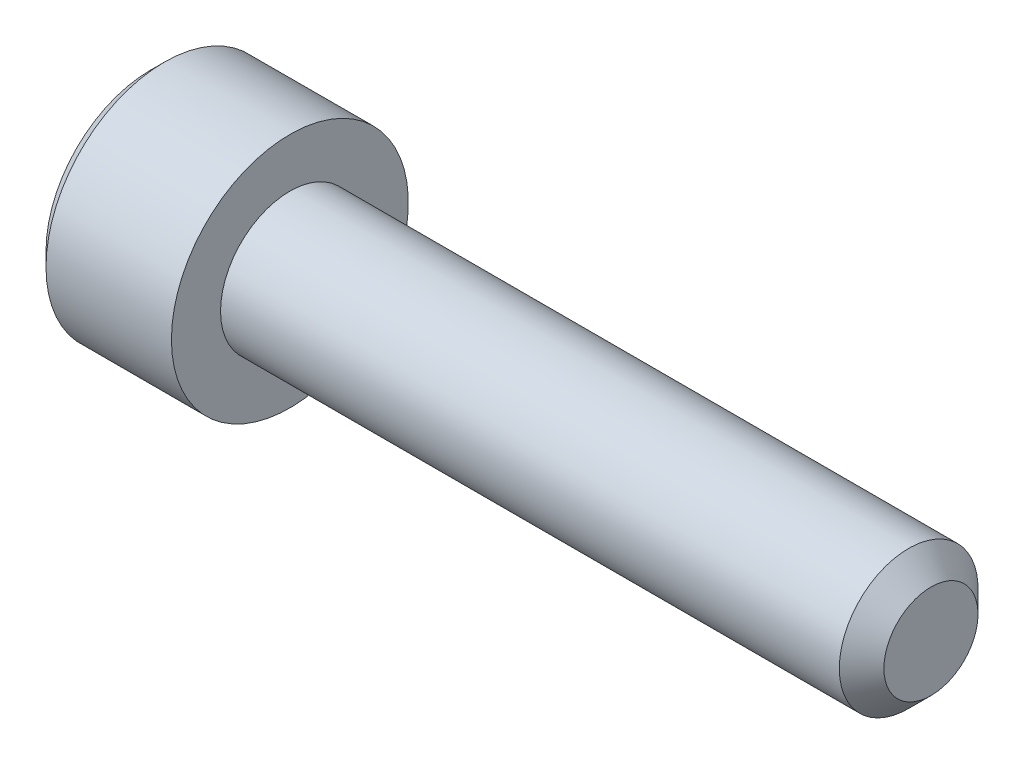
ISO-10303-21;
HEADER;
FILE_DESCRIPTION(('STEP AP214'),'2;1');
FILE_NAME('part.step','',(''),(''),'','','');
FILE_SCHEMA(('AUTOMOTIVE_DESIGN { 1 0 10303 214 1 1 1 1 }'));
ENDSEC;
DATA;
#1=APPLICATION_CONTEXT('core data for automotive mechanical design processes');
#2=APPLICATION_PROTOCOL_DEFINITION('international standard','automotive_design',2000,#1);
#3=PRODUCT_CONTEXT('',#1,'mechanical');
#4=PRODUCT('Part','Part','',(#3));
#5=PRODUCT_RELATED_PRODUCT_CATEGORY('part','',(#4));
#6=PRODUCT_DEFINITION_FORMATION('','',#4);
#7=PRODUCT_DEFINITION_CONTEXT('part definition',#1,'design');
#8=PRODUCT_DEFINITION('design','',#6,#7);
#9=PRODUCT_DEFINITION_SHAPE('','',#8);
#10=(LENGTH_UNIT() NAMED_UNIT(*) SI_UNIT(.MILLI.,.METRE.));
#11=(NAMED_UNIT(*) PLANE_ANGLE_UNIT() SI_UNIT($,.RADIAN.));
#12=(NAMED_UNIT(*) SI_UNIT($,.STERADIAN.) SOLID_ANGLE_UNIT());
#13=UNCERTAINTY_MEASURE_WITH_UNIT(LENGTH_MEASURE(1.E-05),#10,'distance_accuracy_value','');
#14=(GEOMETRIC_REPRESENTATION_CONTEXT(3) GLOBAL_UNCERTAINTY_ASSIGNED_CONTEXT((#13)) GLOBAL_UNIT_ASSIGNED_CONTEXT((#10,
#11,#12)) REPRESENTATION_CONTEXT('',''));
#15=CARTESIAN_POINT('',(0.,0.,0.));
#16=DIRECTION('',(0.,0.,1.));
#17=DIRECTION('',(1.,0.,0.));
#18=AXIS2_PLACEMENT_3D('',#15,#16,#17);
#19=CARTESIAN_POINT('',(0.,0.,0.));
#20=DIRECTION('',(1.,0.,0.));
#21=DIRECTION('',(0.,0.,-1.));
#22=AXIS2_PLACEMENT_3D('',#19,#20,#21);
#23=PLANE('',#22);
#24=DIRECTION('',(0.,0.866025403784439,0.5));
#25=VECTOR('',#24,1.);
#26=CARTESIAN_POINT('',(0.,2.2,-1.50111069989303));
#27=LINE('',#26,#25);
#28=CARTESIAN_POINT('',(0.,0.,-2.77128129211021));
#29=VERTEX_POINT('',#28);
#30=CARTESIAN_POINT('',(0.,2.4,-1.3856406460551));
#31=VERTEX_POINT('',#30);
#32=EDGE_CURVE('E158',#29,#31,#27,.T.);
#33=ORIENTED_EDGE('',*,*,#32,.T.);
#34=DIRECTION('',(0.,0.,1.));
#35=VECTOR('',#34,1.);
#36=CARTESIAN_POINT('',(0.,2.4,1.15470053837925));
#37=LINE('',#36,#35);
#38=CARTESIAN_POINT('',(0.,2.4,1.3856406460551));
#39=VERTEX_POINT('',#38);
#40=EDGE_CURVE('E168',#31,#39,#37,.T.);
#41=ORIENTED_EDGE('',*,*,#40,.T.);
#42=DIRECTION('',(0.,-0.866025403784439,0.5));
#43=VECTOR('',#42,1.);
#44=CARTESIAN_POINT('',(0.,0.200000000000001,2.65581123827228));
#45=LINE('',#44,#43);
#46=CARTESIAN_POINT('',(0.,0.,2.7712812921102));
#47=VERTEX_POINT('',#46);
#48=EDGE_CURVE('E166',#39,#47,#45,.T.);
#49=ORIENTED_EDGE('',*,*,#48,.T.);
#50=DIRECTION('',(0.,-0.866025403784439,-0.499999999999999));
#51=VECTOR('',#50,1.);
#52=CARTESIAN_POINT('',(0.,-2.2,1.50111069989303));
#53=LINE('',#52,#51);
#54=CARTESIAN_POINT('',(0.,-2.4,1.3856406460551));
#55=VERTEX_POINT('',#54);
#56=EDGE_CURVE('E164',#47,#55,#53,.T.);
#57=ORIENTED_EDGE('',*,*,#56,.T.);
#58=DIRECTION('',(0.,0.,-1.));
#59=VECTOR('',#58,1.);
#60=CARTESIAN_POINT('',(0.,-2.4,-1.15470053837925));
#61=LINE('',#60,#59);
#62=CARTESIAN_POINT('',(0.,-2.4,-1.3856406460551));
#63=VERTEX_POINT('',#62);
#64=EDGE_CURVE('E162',#55,#63,#61,.T.);
#65=ORIENTED_EDGE('',*,*,#64,.T.);
#66=DIRECTION('',(0.,0.866025403784439,-0.5));
#67=VECTOR('',#66,1.);
#68=CARTESIAN_POINT('',(0.,-0.2,-2.65581123827228));
#69=LINE('',#68,#67);
#70=EDGE_CURVE('E160',#63,#29,#69,.T.);
#71=ORIENTED_EDGE('',*,*,#70,.T.);
#72=EDGE_LOOP('',(#33,#41,#49,#57,#65,#71));
#73=FACE_BOUND('',#72,.T.);
#74=CARTESIAN_POINT('',(0.,0.,0.));
#75=DIRECTION('',(1.,0.,0.));
#76=DIRECTION('',(0.,0.,-1.));
#77=AXIS2_PLACEMENT_3D('',#74,#75,#76);
#78=CIRCLE('',#77,3.75000000000001);
#79=CARTESIAN_POINT('',(0.,0.,-3.75000000000001));
#80=VERTEX_POINT('',#79);
#81=EDGE_CURVE('E152',#80,#80,#78,.F.);
#82=ORIENTED_EDGE('',*,*,#81,.T.);
#83=EDGE_LOOP('',(#82));
#84=FACE_BOUND('',#83,.T.);
#85=ADVANCED_FACE('F37',(#73,#84),#23,.F.);
#86=CARTESIAN_POINT('',(28.,0.,0.));
#87=DIRECTION('',(-1.,0.,0.));
#88=DIRECTION('',(0.,0.,1.));
#89=AXIS2_PLACEMENT_3D('',#86,#87,#88);
#90=PLANE('',#89);
#91=CARTESIAN_POINT('',(28.,0.,0.));
#92=DIRECTION('',(-1.,0.,0.));
#93=DIRECTION('',(0.,0.,1.));
#94=AXIS2_PLACEMENT_3D('',#91,#92,#93);
#95=CIRCLE('',#94,1.68799999999999);
#96=CARTESIAN_POINT('',(28.,0.,1.68799999999999));
#97=VERTEX_POINT('',#96);
#98=EDGE_CURVE('E149',#97,#97,#95,.F.);
#99=ORIENTED_EDGE('',*,*,#98,.T.);
#100=EDGE_LOOP('',(#99));
#101=FACE_BOUND('',#100,.T.);
#102=ADVANCED_FACE('F248',(#101),#90,.F.);
#103=CARTESIAN_POINT('',(-88.7054908485857,0.,0.));
#104=DIRECTION('',(-1.,0.,0.));
#105=DIRECTION('',(0.,0.,1.));
#106=AXIS2_PLACEMENT_3D('',#103,#104,#105);
#107=CYLINDRICAL_SURFACE('',#106,2.488);
#108=CARTESIAN_POINT('',(27.2,0.,0.));
#109=DIRECTION('',(-1.,0.,0.));
#110=DIRECTION('',(0.,0.,1.));
#111=AXIS2_PLACEMENT_3D('',#108,#109,#110);
#112=CIRCLE('',#111,2.488);
#113=CARTESIAN_POINT('',(27.2,0.,2.488));
#114=VERTEX_POINT('',#113);
#115=EDGE_CURVE('E146',#114,#114,#112,.T.);
#116=ORIENTED_EDGE('',*,*,#115,.T.);
#117=EDGE_LOOP('',(#116));
#118=FACE_BOUND('',#117,.T.);
#119=CARTESIAN_POINT('',(5.,0.,0.));
#120=DIRECTION('',(-1.,0.,0.));
#121=DIRECTION('',(0.,0.,1.));
#122=AXIS2_PLACEMENT_3D('',#119,#120,#121);
#123=CIRCLE('',#122,2.488);
#124=CARTESIAN_POINT('',(5.,0.,2.488));
#125=VERTEX_POINT('',#124);
#126=EDGE_CURVE('E138',#125,#125,#123,.T.);
#127=ORIENTED_EDGE('',*,*,#126,.F.);
#128=EDGE_LOOP('',(#127));
#129=FACE_BOUND('',#128,.T.);
#130=ADVANCED_FACE('F253',(#118,#129),#107,.T.);
#131=CARTESIAN_POINT('',(5.,2.488,0.));
#132=DIRECTION('',(-1.,0.,0.));
#133=DIRECTION('',(0.,0.,1.));
#134=AXIS2_PLACEMENT_3D('',#131,#132,#133);
#135=PLANE('',#134);
#136=CARTESIAN_POINT('',(5.,0.,0.));
#137=DIRECTION('',(-1.,0.,0.));
#138=DIRECTION('',(0.,0.,1.));
#139=AXIS2_PLACEMENT_3D('',#136,#137,#138);
#140=CIRCLE('',#139,4.25);
#141=CARTESIAN_POINT('',(5.,0.,4.25));
#142=VERTEX_POINT('',#141);
#143=EDGE_CURVE('E134',#142,#142,#140,.T.);
#144=ORIENTED_EDGE('',*,*,#143,.F.);
#145=EDGE_LOOP('',(#144));
#146=FACE_BOUND('',#145,.T.);
#147=ORIENTED_EDGE('',*,*,#126,.T.);
#148=EDGE_LOOP('',(#147));
#149=FACE_BOUND('',#148,.T.);
#150=ADVANCED_FACE('F263',(#146,#149),#135,.F.);
#151=CARTESIAN_POINT('',(-88.7054908485857,0.,0.));
#152=DIRECTION('',(-1.,0.,0.));
#153=DIRECTION('',(0.,0.,1.));
#154=AXIS2_PLACEMENT_3D('',#151,#152,#153);
#155=CYLINDRICAL_SURFACE('',#154,4.25);
#156=CARTESIAN_POINT('',(0.5,0.,0.));
#157=DIRECTION('',(1.,0.,0.));
#158=DIRECTION('',(0.,0.,-1.));
#159=AXIS2_PLACEMENT_3D('',#156,#157,#158);
#160=CIRCLE('',#159,4.25);
#161=CARTESIAN_POINT('',(0.5,0.,-4.25));
#162=VERTEX_POINT('',#161);
#163=EDGE_CURVE('E155',#162,#162,#160,.T.);
#164=ORIENTED_EDGE('',*,*,#163,.T.);
#165=EDGE_LOOP('',(#164));
#166=FACE_BOUND('',#165,.T.);
#167=ORIENTED_EDGE('',*,*,#143,.T.);
#168=EDGE_LOOP('',(#167));
#169=FACE_BOUND('',#168,.T.);
#170=ADVANCED_FACE('F259',(#166,#169),#155,.T.);
#171=CARTESIAN_POINT('',(27.2,0.,0.));
#172=DIRECTION('',(-1.,0.,0.));
#173=DIRECTION('',(0.,0.,1.));
#174=AXIS2_PLACEMENT_3D('',#171,#172,#173);
#175=CONICAL_SURFACE('',#174,2.488,0.785398163397453);
#176=ORIENTED_EDGE('',*,*,#98,.F.);
#177=EDGE_LOOP('',(#176));
#178=FACE_BOUND('',#177,.T.);
#179=ORIENTED_EDGE('',*,*,#115,.F.);
#180=EDGE_LOOP('',(#179));
#181=FACE_BOUND('',#180,.T.);
#182=ADVANCED_FACE('F262',(#178,#181),#175,.T.);
#183=CARTESIAN_POINT('',(0.,0.,0.));
#184=DIRECTION('',(1.,0.,0.));
#185=DIRECTION('',(0.,0.,-1.));
#186=AXIS2_PLACEMENT_3D('',#183,#184,#185);
#187=CONICAL_SURFACE('',#186,3.75000000000001,0.785398163397438);
#188=ORIENTED_EDGE('',*,*,#163,.F.);
#189=EDGE_LOOP('',(#188));
#190=FACE_BOUND('',#189,.T.);
#191=ORIENTED_EDGE('',*,*,#81,.F.);
#192=EDGE_LOOP('',(#191));
#193=FACE_BOUND('',#192,.T.);
#194=ADVANCED_FACE('F273',(#190,#193),#187,.T.);
#195=CARTESIAN_POINT('',(2.5,2.,1.15470053837925));
#196=DIRECTION('',(0.,-0.5,-0.866025403784439));
#197=DIRECTION('',(0.,0.866025403784439,-0.5));
#198=AXIS2_PLACEMENT_3D('',#195,#196,#197);
#199=PLANE('',#198);
#200=DIRECTION('',(-1.,0.,0.));
#201=VECTOR('',#200,1.);
#202=CARTESIAN_POINT('',(2.5,0.,2.3094010767585));
#203=LINE('',#202,#201);
#204=CARTESIAN_POINT('',(2.5,0.,2.3094010767585));
#205=VERTEX_POINT('',#204);
#206=CARTESIAN_POINT('',(0.400000000000005,0.,2.3094010767585));
#207=VERTEX_POINT('',#206);
#208=EDGE_CURVE('E126',#205,#207,#203,.T.);
#209=ORIENTED_EDGE('',*,*,#208,.T.);
#210=DIRECTION('',(0.,0.866025403784439,-0.5));
#211=VECTOR('',#210,1.);
#212=CARTESIAN_POINT('',(0.400000000000004,2.,1.15470053837925));
#213=LINE('',#212,#211);
#214=CARTESIAN_POINT('',(0.400000000000005,2.,1.15470053837925));
#215=VERTEX_POINT('',#214);
#216=EDGE_CURVE('E174',#207,#215,#213,.T.);
#217=ORIENTED_EDGE('',*,*,#216,.T.);
#218=DIRECTION('',(-1.,0.,0.));
#219=VECTOR('',#218,1.);
#220=CARTESIAN_POINT('',(2.5,2.,1.15470053837925));
#221=LINE('',#220,#219);
#222=CARTESIAN_POINT('',(2.5,2.,1.15470053837925));
#223=VERTEX_POINT('',#222);
#224=EDGE_CURVE('E129',#223,#215,#221,.T.);
#225=ORIENTED_EDGE('',*,*,#224,.F.);
#226=DIRECTION('',(0.,-0.866025403784439,0.5));
#227=VECTOR('',#226,1.);
#228=CARTESIAN_POINT('',(2.5,2.,1.15470053837925));
#229=LINE('',#228,#227);
#230=EDGE_CURVE('E114',#223,#205,#229,.T.);
#231=ORIENTED_EDGE('',*,*,#230,.T.);
#232=EDGE_LOOP('',(#209,#217,#225,#231));
#233=FACE_BOUND('',#232,.T.);
#234=ADVANCED_FACE('F125',(#233),#199,.T.);
#235=CARTESIAN_POINT('',(2.5,0.,2.3094010767585));
#236=DIRECTION('',(0.,0.499999999999999,-0.866025403784439));
#237=DIRECTION('',(0.,0.866025403784439,0.499999999999999));
#238=AXIS2_PLACEMENT_3D('',#235,#236,#237);
#239=PLANE('',#238);
#240=DIRECTION('',(-1.,0.,0.));
#241=VECTOR('',#240,1.);
#242=CARTESIAN_POINT('',(2.5,-2.,1.15470053837925));
#243=LINE('',#242,#241);
#244=CARTESIAN_POINT('',(2.5,-2.,1.15470053837925));
#245=VERTEX_POINT('',#244);
#246=CARTESIAN_POINT('',(0.400000000000005,-2.,1.15470053837925));
#247=VERTEX_POINT('',#246);
#248=EDGE_CURVE('E135',#245,#247,#243,.T.);
#249=ORIENTED_EDGE('',*,*,#248,.T.);
#250=DIRECTION('',(0.,0.866025403784439,0.499999999999999));
#251=VECTOR('',#250,1.);
#252=CARTESIAN_POINT('',(0.400000000000004,0.,2.3094010767585));
#253=LINE('',#252,#251);
#254=EDGE_CURVE('E133',#247,#207,#253,.T.);
#255=ORIENTED_EDGE('',*,*,#254,.T.);
#256=ORIENTED_EDGE('',*,*,#208,.F.);
#257=DIRECTION('',(0.,-0.866025403784439,-0.499999999999999));
#258=VECTOR('',#257,1.);
#259=CARTESIAN_POINT('',(2.5,0.,2.3094010767585));
#260=LINE('',#259,#258);
#261=EDGE_CURVE('E110',#205,#245,#260,.T.);
#262=ORIENTED_EDGE('',*,*,#261,.T.);
#263=EDGE_LOOP('',(#249,#255,#256,#262));
#264=FACE_BOUND('',#263,.T.);
#265=ADVANCED_FACE('F131',(#264),#239,.T.);
#266=CARTESIAN_POINT('',(2.5,-2.,1.15470053837925));
#267=DIRECTION('',(0.,1.,0.));
#268=DIRECTION('',(0.,0.,1.));
#269=AXIS2_PLACEMENT_3D('',#266,#267,#268);
#270=PLANE('',#269);
#271=DIRECTION('',(-1.,0.,0.));
#272=VECTOR('',#271,1.);
#273=CARTESIAN_POINT('',(2.5,-2.,-1.15470053837925));
#274=LINE('',#273,#272);
#275=CARTESIAN_POINT('',(2.5,-2.,-1.15470053837925));
#276=VERTEX_POINT('',#275);
#277=CARTESIAN_POINT('',(0.400000000000005,-2.,-1.15470053837925));
#278=VERTEX_POINT('',#277);
#279=EDGE_CURVE('E140',#276,#278,#274,.T.);
#280=ORIENTED_EDGE('',*,*,#279,.T.);
#281=DIRECTION('',(0.,0.,1.));
#282=VECTOR('',#281,1.);
#283=CARTESIAN_POINT('',(0.400000000000005,-2.,1.15470053837925));
#284=LINE('',#283,#282);
#285=EDGE_CURVE('E177',#278,#247,#284,.T.);
#286=ORIENTED_EDGE('',*,*,#285,.T.);
#287=ORIENTED_EDGE('',*,*,#248,.F.);
#288=DIRECTION('',(0.,0.,-1.));
#289=VECTOR('',#288,1.);
#290=CARTESIAN_POINT('',(2.5,-2.,1.15470053837925));
#291=LINE('',#290,#289);
#292=EDGE_CURVE('E116',#245,#276,#291,.T.);
#293=ORIENTED_EDGE('',*,*,#292,.T.);
#294=EDGE_LOOP('',(#280,#286,#287,#293));
#295=FACE_BOUND('',#294,.T.);
#296=ADVANCED_FACE('F204',(#295),#270,.T.);
#297=CARTESIAN_POINT('',(2.5,-2.,-1.15470053837925));
#298=DIRECTION('',(0.,0.5,0.866025403784439));
#299=DIRECTION('',(0.,-0.866025403784439,0.5));
#300=AXIS2_PLACEMENT_3D('',#297,#298,#299);
#301=PLANE('',#300);
#302=DIRECTION('',(-1.,0.,0.));
#303=VECTOR('',#302,1.);
#304=CARTESIAN_POINT('',(2.5,0.,-2.3094010767585));
#305=LINE('',#304,#303);
#306=CARTESIAN_POINT('',(2.5,0.,-2.3094010767585));
#307=VERTEX_POINT('',#306);
#308=CARTESIAN_POINT('',(0.400000000000005,0.,-2.3094010767585));
#309=VERTEX_POINT('',#308);
#310=EDGE_CURVE('E205',#307,#309,#305,.T.);
#311=ORIENTED_EDGE('',*,*,#310,.T.);
#312=DIRECTION('',(0.,-0.866025403784439,0.5));
#313=VECTOR('',#312,1.);
#314=CARTESIAN_POINT('',(0.400000000000004,-2.,-1.15470053837925));
#315=LINE('',#314,#313);
#316=EDGE_CURVE('E46',#309,#278,#315,.T.);
#317=ORIENTED_EDGE('',*,*,#316,.T.);
#318=ORIENTED_EDGE('',*,*,#279,.F.);
#319=DIRECTION('',(0.,0.866025403784439,-0.5));
#320=VECTOR('',#319,1.);
#321=CARTESIAN_POINT('',(2.5,-2.,-1.15470053837925));
#322=LINE('',#321,#320);
#323=EDGE_CURVE('E215',#276,#307,#322,.T.);
#324=ORIENTED_EDGE('',*,*,#323,.T.);
#325=EDGE_LOOP('',(#311,#317,#318,#324));
#326=FACE_BOUND('',#325,.T.);
#327=ADVANCED_FACE('F217',(#326),#301,.T.);
#328=CARTESIAN_POINT('',(2.5,0.,-2.3094010767585));
#329=DIRECTION('',(0.,-0.5,0.866025403784439));
#330=DIRECTION('',(0.,-0.866025403784439,-0.5));
#331=AXIS2_PLACEMENT_3D('',#328,#329,#330);
#332=PLANE('',#331);
#333=DIRECTION('',(-1.,0.,0.));
#334=VECTOR('',#333,1.);
#335=CARTESIAN_POINT('',(2.5,2.,-1.15470053837925));
#336=LINE('',#335,#334);
#337=CARTESIAN_POINT('',(2.5,2.,-1.15470053837925));
#338=VERTEX_POINT('',#337);
#339=CARTESIAN_POINT('',(0.400000000000005,2.,-1.15470053837925));
#340=VERTEX_POINT('',#339);
#341=EDGE_CURVE('E206',#338,#340,#336,.T.);
#342=ORIENTED_EDGE('',*,*,#341,.T.);
#343=DIRECTION('',(0.,-0.866025403784439,-0.5));
#344=VECTOR('',#343,1.);
#345=CARTESIAN_POINT('',(0.400000000000005,0.,-2.3094010767585));
#346=LINE('',#345,#344);
#347=EDGE_CURVE('E11',#340,#309,#346,.T.);
#348=ORIENTED_EDGE('',*,*,#347,.T.);
#349=ORIENTED_EDGE('',*,*,#310,.F.);
#350=DIRECTION('',(0.,0.866025403784439,0.5));
#351=VECTOR('',#350,1.);
#352=CARTESIAN_POINT('',(2.5,0.,-2.3094010767585));
#353=LINE('',#352,#351);
#354=EDGE_CURVE('E213',#307,#338,#353,.T.);
#355=ORIENTED_EDGE('',*,*,#354,.T.);
#356=EDGE_LOOP('',(#342,#348,#349,#355));
#357=FACE_BOUND('',#356,.T.);
#358=ADVANCED_FACE('F219',(#357),#332,.T.);
#359=CARTESIAN_POINT('',(2.5,2.,-1.15470053837925));
#360=DIRECTION('',(0.,-1.,0.));
#361=DIRECTION('',(0.,0.,-1.));
#362=AXIS2_PLACEMENT_3D('',#359,#360,#361);
#363=PLANE('',#362);
#364=ORIENTED_EDGE('',*,*,#224,.T.);
#365=DIRECTION('',(0.,0.,-1.));
#366=VECTOR('',#365,1.);
#367=CARTESIAN_POINT('',(0.400000000000005,2.,-1.15470053837925));
#368=LINE('',#367,#366);
#369=EDGE_CURVE('E171',#215,#340,#368,.T.);
#370=ORIENTED_EDGE('',*,*,#369,.T.);
#371=ORIENTED_EDGE('',*,*,#341,.F.);
#372=DIRECTION('',(0.,0.,1.));
#373=VECTOR('',#372,1.);
#374=CARTESIAN_POINT('',(2.5,2.,-1.15470053837925));
#375=LINE('',#374,#373);
#376=EDGE_CURVE('E211',#338,#223,#375,.T.);
#377=ORIENTED_EDGE('',*,*,#376,.T.);
#378=EDGE_LOOP('',(#364,#370,#371,#377));
#379=FACE_BOUND('',#378,.T.);
#380=ADVANCED_FACE('F222',(#379),#363,.T.);
#381=CARTESIAN_POINT('',(2.5,0.,0.));
#382=DIRECTION('',(1.,0.,0.));
#383=DIRECTION('',(0.,0.,-1.));
#384=AXIS2_PLACEMENT_3D('',#381,#382,#383);
#385=PLANE('',#384);
#386=ORIENTED_EDGE('',*,*,#230,.F.);
#387=ORIENTED_EDGE('',*,*,#376,.F.);
#388=ORIENTED_EDGE('',*,*,#354,.F.);
#389=ORIENTED_EDGE('',*,*,#323,.F.);
#390=ORIENTED_EDGE('',*,*,#292,.F.);
#391=ORIENTED_EDGE('',*,*,#261,.F.);
#392=EDGE_LOOP('',(#386,#387,#388,#389,#390,#391));
#393=FACE_BOUND('',#392,.T.);
#394=ADVANCED_FACE('F112',(#393),#385,.F.);
#395=CARTESIAN_POINT('',(0.,-2.4,0.));
#396=DIRECTION('',(-0.707106781186544,0.707106781186551,0.));
#397=DIRECTION('',(0.,0.,1.));
#398=AXIS2_PLACEMENT_3D('',#395,#396,#397);
#399=PLANE('',#398);
#400=DIRECTION('',(0.65465367070798,0.654653670707975,-0.377964473009226));
#401=VECTOR('',#400,1.);
#402=CARTESIAN_POINT('',(0.342857142857144,-2.05714285714286,1.18769198233295));
#403=LINE('',#402,#401);
#404=EDGE_CURVE('E189',#247,#55,#403,.F.);
#405=ORIENTED_EDGE('',*,*,#404,.F.);
#406=ORIENTED_EDGE('',*,*,#285,.F.);
#407=DIRECTION('',(0.65465367070798,0.654653670707975,0.377964473009226));
#408=VECTOR('',#407,1.);
#409=CARTESIAN_POINT('',(0.342857142857143,-2.05714285714286,-1.18769198233295));
#410=LINE('',#409,#408);
#411=EDGE_CURVE('E41',#63,#278,#410,.T.);
#412=ORIENTED_EDGE('',*,*,#411,.F.);
#413=ORIENTED_EDGE('',*,*,#64,.F.);
#414=EDGE_LOOP('',(#405,#406,#412,#413));
#415=FACE_BOUND('',#414,.T.);
#416=ADVANCED_FACE('F39',(#415),#399,.T.);
#417=CARTESIAN_POINT('',(0.,-1.2,-2.07846096908265));
#418=DIRECTION('',(-0.707106781186544,0.353553390593275,0.612372435695797));
#419=DIRECTION('',(0.,-0.866025403784439,0.5));
#420=AXIS2_PLACEMENT_3D('',#417,#418,#419);
#421=PLANE('',#420);
#422=ORIENTED_EDGE('',*,*,#411,.T.);
#423=ORIENTED_EDGE('',*,*,#316,.F.);
#424=DIRECTION('',(0.65465367070798,0.,0.755928946018452));
#425=VECTOR('',#424,1.);
#426=CARTESIAN_POINT('',(0.342857142857144,0.,-2.37538396466589));
#427=LINE('',#426,#425);
#428=EDGE_CURVE('E187',#29,#309,#427,.T.);
#429=ORIENTED_EDGE('',*,*,#428,.F.);
#430=ORIENTED_EDGE('',*,*,#70,.F.);
#431=EDGE_LOOP('',(#422,#423,#429,#430));
#432=FACE_BOUND('',#431,.T.);
#433=ADVANCED_FACE('F198',(#432),#421,.T.);
#434=CARTESIAN_POINT('',(0.,-1.2,2.07846096908265));
#435=DIRECTION('',(-0.707106781186544,0.353553390593275,-0.612372435695798));
#436=DIRECTION('',(0.,0.866025403784439,0.499999999999999));
#437=AXIS2_PLACEMENT_3D('',#434,#435,#436);
#438=PLANE('',#437);
#439=ORIENTED_EDGE('',*,*,#404,.T.);
#440=ORIENTED_EDGE('',*,*,#56,.F.);
#441=DIRECTION('',(0.654653670707981,0.,-0.755928946018451));
#442=VECTOR('',#441,1.);
#443=CARTESIAN_POINT('',(0.342857142857143,0.,2.37538396466589));
#444=LINE('',#443,#442);
#445=EDGE_CURVE('E184',#207,#47,#444,.F.);
#446=ORIENTED_EDGE('',*,*,#445,.F.);
#447=ORIENTED_EDGE('',*,*,#254,.F.);
#448=EDGE_LOOP('',(#439,#440,#446,#447));
#449=FACE_BOUND('',#448,.T.);
#450=ADVANCED_FACE('F239',(#449),#438,.T.);
#451=CARTESIAN_POINT('',(0.,1.2,-2.07846096908265));
#452=DIRECTION('',(-0.707106781186545,-0.353553390593275,0.612372435695797));
#453=DIRECTION('',(0.,-0.866025403784439,-0.5));
#454=AXIS2_PLACEMENT_3D('',#451,#452,#453);
#455=PLANE('',#454);
#456=ORIENTED_EDGE('',*,*,#428,.T.);
#457=ORIENTED_EDGE('',*,*,#347,.F.);
#458=DIRECTION('',(-0.65465367070798,0.654653670707975,-0.377964473009226));
#459=VECTOR('',#458,1.);
#460=CARTESIAN_POINT('',(0.342857142857144,2.05714285714286,-1.18769198233295));
#461=LINE('',#460,#459);
#462=EDGE_CURVE('E182',#31,#340,#461,.F.);
#463=ORIENTED_EDGE('',*,*,#462,.F.);
#464=ORIENTED_EDGE('',*,*,#32,.F.);
#465=EDGE_LOOP('',(#456,#457,#463,#464));
#466=FACE_BOUND('',#465,.T.);
#467=ADVANCED_FACE('F237',(#466),#455,.T.);
#468=CARTESIAN_POINT('',(0.,1.2,2.07846096908265));
#469=DIRECTION('',(-0.707106781186544,-0.353553390593275,-0.612372435695797));
#470=DIRECTION('',(0.,0.866025403784439,-0.5));
#471=AXIS2_PLACEMENT_3D('',#468,#469,#470);
#472=PLANE('',#471);
#473=ORIENTED_EDGE('',*,*,#445,.T.);
#474=ORIENTED_EDGE('',*,*,#48,.F.);
#475=DIRECTION('',(0.654653670707981,-0.654653670707975,-0.377964473009225));
#476=VECTOR('',#475,1.);
#477=CARTESIAN_POINT('',(0.342857142857143,2.05714285714286,1.18769198233295));
#478=LINE('',#477,#476);
#479=EDGE_CURVE('E180',#215,#39,#478,.F.);
#480=ORIENTED_EDGE('',*,*,#479,.F.);
#481=ORIENTED_EDGE('',*,*,#216,.F.);
#482=EDGE_LOOP('',(#473,#474,#480,#481));
#483=FACE_BOUND('',#482,.T.);
#484=ADVANCED_FACE('F232',(#483),#472,.T.);
#485=CARTESIAN_POINT('',(0.,2.4,0.));
#486=DIRECTION('',(-0.707106781186544,-0.707106781186551,0.));
#487=DIRECTION('',(0.,0.,-1.));
#488=AXIS2_PLACEMENT_3D('',#485,#486,#487);
#489=PLANE('',#488);
#490=ORIENTED_EDGE('',*,*,#462,.T.);
#491=ORIENTED_EDGE('',*,*,#369,.F.);
#492=ORIENTED_EDGE('',*,*,#479,.T.);
#493=ORIENTED_EDGE('',*,*,#40,.F.);
#494=EDGE_LOOP('',(#490,#491,#492,#493));
#495=FACE_BOUND('',#494,.T.);
#496=ADVANCED_FACE('F226',(#495),#489,.T.);
#497=CLOSED_SHELL('',(#85,#102,#130,#150,#170,#182,#194,#234,#265,#296,#327,#358,#380,#394,#416,
#433,#450,#467,#484,#496));
#498=MANIFOLD_SOLID_BREP('B2',#497);
#499=ADVANCED_BREP_SHAPE_REPRESENTATION('',(#18,#498),#14);
#500=SHAPE_DEFINITION_REPRESENTATION(#9,#499);
ENDSEC;
END-ISO-10303-21;
